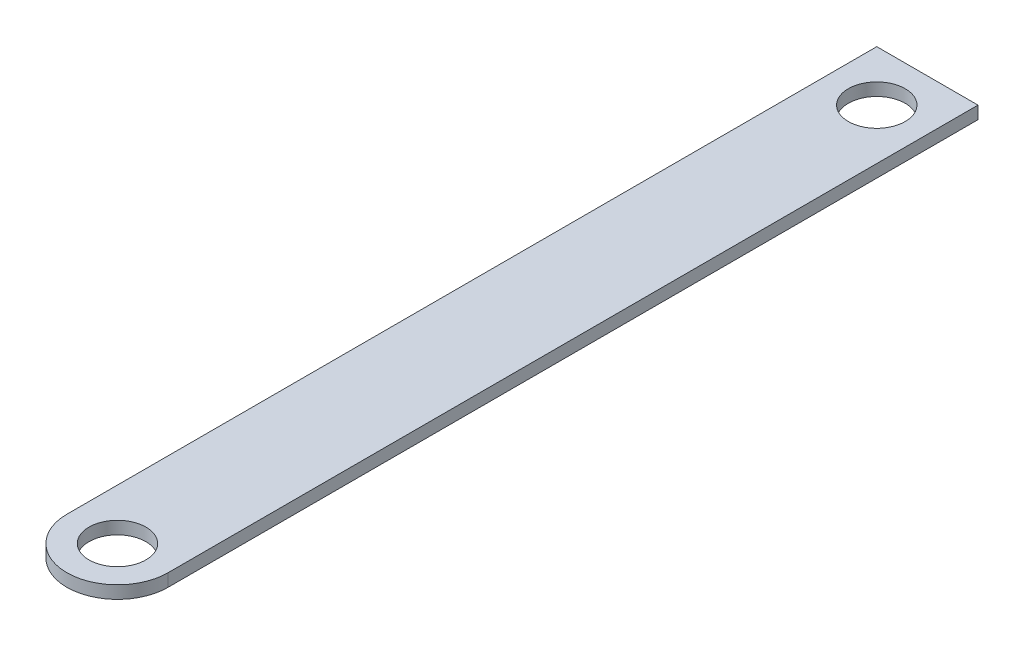
ISO-10303-21;
HEADER;
FILE_DESCRIPTION(('STEP AP214'),'2;1');
FILE_NAME('part.step','',(''),(''),'','','');
FILE_SCHEMA(('AUTOMOTIVE_DESIGN { 1 0 10303 214 1 1 1 1 }'));
ENDSEC;
DATA;
#1=APPLICATION_CONTEXT('core data for automotive mechanical design processes');
#2=APPLICATION_PROTOCOL_DEFINITION('international standard','automotive_design',2000,#1);
#3=PRODUCT_CONTEXT('',#1,'mechanical');
#4=PRODUCT('Part','Part','',(#3));
#5=PRODUCT_RELATED_PRODUCT_CATEGORY('part','',(#4));
#6=PRODUCT_DEFINITION_FORMATION('','',#4);
#7=PRODUCT_DEFINITION_CONTEXT('part definition',#1,'design');
#8=PRODUCT_DEFINITION('design','',#6,#7);
#9=PRODUCT_DEFINITION_SHAPE('','',#8);
#10=(LENGTH_UNIT() NAMED_UNIT(*) SI_UNIT(.MILLI.,.METRE.));
#11=(NAMED_UNIT(*) PLANE_ANGLE_UNIT() SI_UNIT($,.RADIAN.));
#12=(NAMED_UNIT(*) SI_UNIT($,.STERADIAN.) SOLID_ANGLE_UNIT());
#13=UNCERTAINTY_MEASURE_WITH_UNIT(LENGTH_MEASURE(1.E-05),#10,'distance_accuracy_value','');
#14=(GEOMETRIC_REPRESENTATION_CONTEXT(3) GLOBAL_UNCERTAINTY_ASSIGNED_CONTEXT((#13)) GLOBAL_UNIT_ASSIGNED_CONTEXT((#10,
#11,#12)) REPRESENTATION_CONTEXT('',''));
#15=CARTESIAN_POINT('',(0.,0.,0.));
#16=DIRECTION('',(0.,0.,1.));
#17=DIRECTION('',(1.,0.,0.));
#18=AXIS2_PLACEMENT_3D('',#15,#16,#17);
#19=CARTESIAN_POINT('',(25.4000000000001,6.35,-1.04083408558608E-13));
#20=DIRECTION('',(0.,1.,0.));
#21=DIRECTION('',(0.,0.,1.));
#22=AXIS2_PLACEMENT_3D('',#19,#20,#21);
#23=PLANE('',#22);
#24=CARTESIAN_POINT('',(25.4,6.35,0.));
#25=DIRECTION('',(0.,1.,0.));
#26=DIRECTION('',(0.,0.,1.));
#27=AXIS2_PLACEMENT_3D('',#24,#25,#26);
#28=CIRCLE('',#27,14.2748);
#29=CARTESIAN_POINT('',(25.4,6.35,14.2748));
#30=VERTEX_POINT('',#29);
#31=EDGE_CURVE('E99',#30,#30,#28,.T.);
#32=ORIENTED_EDGE('',*,*,#31,.F.);
#33=EDGE_LOOP('',(#32));
#34=FACE_BOUND('',#33,.T.);
#35=CARTESIAN_POINT('',(25.4000000000001,6.35,-1.04083408558608E-13));
#36=DIRECTION('',(0.,1.,0.));
#37=DIRECTION('',(0.,0.,1.));
#38=AXIS2_PLACEMENT_3D('',#35,#36,#37);
#39=CIRCLE('',#38,25.4000000000001);
#40=CARTESIAN_POINT('',(0.,6.35,0.));
#41=VERTEX_POINT('',#40);
#42=CARTESIAN_POINT('',(50.8,6.35,0.));
#43=VERTEX_POINT('',#42);
#44=EDGE_CURVE('E79',#41,#43,#39,.T.);
#45=ORIENTED_EDGE('',*,*,#44,.T.);
#46=DIRECTION('',(0.,0.,-1.));
#47=VECTOR('',#46,1.);
#48=CARTESIAN_POINT('',(50.8,6.35,0.));
#49=LINE('',#48,#47);
#50=CARTESIAN_POINT('',(50.8000000000001,6.35,-406.4));
#51=VERTEX_POINT('',#50);
#52=EDGE_CURVE('E82',#43,#51,#49,.T.);
#53=ORIENTED_EDGE('',*,*,#52,.T.);
#54=DIRECTION('',(-1.,0.,0.));
#55=VECTOR('',#54,1.);
#56=CARTESIAN_POINT('',(0.,6.35,-406.4));
#57=LINE('',#56,#55);
#58=CARTESIAN_POINT('',(0.,6.35,-406.4));
#59=VERTEX_POINT('',#58);
#60=EDGE_CURVE('E86',#51,#59,#57,.T.);
#61=ORIENTED_EDGE('',*,*,#60,.T.);
#62=DIRECTION('',(0.,0.,1.));
#63=VECTOR('',#62,1.);
#64=CARTESIAN_POINT('',(0.,6.35,0.));
#65=LINE('',#64,#63);
#66=EDGE_CURVE('E50',#59,#41,#65,.T.);
#67=ORIENTED_EDGE('',*,*,#66,.T.);
#68=EDGE_LOOP('',(#45,#53,#61,#67));
#69=FACE_BOUND('',#68,.T.);
#70=CARTESIAN_POINT('',(25.4000000000001,6.35,-381.));
#71=DIRECTION('',(0.,1.,0.));
#72=DIRECTION('',(0.,0.,1.));
#73=AXIS2_PLACEMENT_3D('',#70,#71,#72);
#74=CIRCLE('',#73,14.2748);
#75=CARTESIAN_POINT('',(25.4000000000001,6.35,-366.7252));
#76=VERTEX_POINT('',#75);
#77=EDGE_CURVE('E120',#76,#76,#74,.T.);
#78=ORIENTED_EDGE('',*,*,#77,.F.);
#79=EDGE_LOOP('',(#78));
#80=FACE_BOUND('',#79,.T.);
#81=ADVANCED_FACE('F33',(#34,#69,#80),#23,.T.);
#82=CARTESIAN_POINT('',(25.4000000000001,0.,-1.04083408558608E-13));
#83=DIRECTION('',(0.,1.,0.));
#84=DIRECTION('',(0.,0.,1.));
#85=AXIS2_PLACEMENT_3D('',#82,#83,#84);
#86=PLANE('',#85);
#87=CARTESIAN_POINT('',(25.4,0.,0.));
#88=DIRECTION('',(0.,1.,0.));
#89=DIRECTION('',(0.,0.,-1.));
#90=AXIS2_PLACEMENT_3D('',#87,#88,#89);
#91=CIRCLE('',#90,25.4);
#92=CARTESIAN_POINT('',(0.,0.,0.));
#93=VERTEX_POINT('',#92);
#94=CARTESIAN_POINT('',(50.8,0.,0.));
#95=VERTEX_POINT('',#94);
#96=EDGE_CURVE('E74',#93,#95,#91,.T.);
#97=ORIENTED_EDGE('',*,*,#96,.F.);
#98=DIRECTION('',(0.,0.,1.));
#99=VECTOR('',#98,1.);
#100=CARTESIAN_POINT('',(0.,0.,0.));
#101=LINE('',#100,#99);
#102=CARTESIAN_POINT('',(0.,0.,-406.4));
#103=VERTEX_POINT('',#102);
#104=EDGE_CURVE('E102',#103,#93,#101,.T.);
#105=ORIENTED_EDGE('',*,*,#104,.F.);
#106=DIRECTION('',(-1.,0.,0.));
#107=VECTOR('',#106,1.);
#108=CARTESIAN_POINT('',(0.,0.,-406.4));
#109=LINE('',#108,#107);
#110=CARTESIAN_POINT('',(50.8000000000001,0.,-406.4));
#111=VERTEX_POINT('',#110);
#112=EDGE_CURVE('E67',#111,#103,#109,.T.);
#113=ORIENTED_EDGE('',*,*,#112,.F.);
#114=DIRECTION('',(0.,0.,-1.));
#115=VECTOR('',#114,1.);
#116=CARTESIAN_POINT('',(50.8,0.,0.));
#117=LINE('',#116,#115);
#118=EDGE_CURVE('E90',#95,#111,#117,.T.);
#119=ORIENTED_EDGE('',*,*,#118,.F.);
#120=EDGE_LOOP('',(#97,#105,#113,#119));
#121=FACE_BOUND('',#120,.T.);
#122=CARTESIAN_POINT('',(25.4,0.,0.));
#123=DIRECTION('',(0.,1.,0.));
#124=DIRECTION('',(0.,0.,1.));
#125=AXIS2_PLACEMENT_3D('',#122,#123,#124);
#126=CIRCLE('',#125,14.2748);
#127=CARTESIAN_POINT('',(25.4,0.,14.2748));
#128=VERTEX_POINT('',#127);
#129=EDGE_CURVE('E115',#128,#128,#126,.T.);
#130=ORIENTED_EDGE('',*,*,#129,.T.);
#131=EDGE_LOOP('',(#130));
#132=FACE_BOUND('',#131,.T.);
#133=CARTESIAN_POINT('',(25.4000000000001,0.,-381.));
#134=DIRECTION('',(0.,1.,0.));
#135=DIRECTION('',(0.,0.,1.));
#136=AXIS2_PLACEMENT_3D('',#133,#134,#135);
#137=CIRCLE('',#136,14.2748);
#138=CARTESIAN_POINT('',(25.4000000000001,0.,-366.7252));
#139=VERTEX_POINT('',#138);
#140=EDGE_CURVE('E118',#139,#139,#137,.T.);
#141=ORIENTED_EDGE('',*,*,#140,.T.);
#142=EDGE_LOOP('',(#141));
#143=FACE_BOUND('',#142,.T.);
#144=ADVANCED_FACE('F108',(#121,#132,#143),#86,.F.);
#145=CARTESIAN_POINT('',(25.4,6.35,0.));
#146=DIRECTION('',(0.,-1.,0.));
#147=DIRECTION('',(0.,0.,-1.));
#148=AXIS2_PLACEMENT_3D('',#145,#146,#147);
#149=CYLINDRICAL_SURFACE('',#148,25.4);
#150=ORIENTED_EDGE('',*,*,#96,.T.);
#151=DIRECTION('',(0.,-1.,0.));
#152=VECTOR('',#151,1.);
#153=CARTESIAN_POINT('',(50.8,6.35,0.));
#154=LINE('',#153,#152);
#155=EDGE_CURVE('E11',#43,#95,#154,.T.);
#156=ORIENTED_EDGE('',*,*,#155,.F.);
#157=ORIENTED_EDGE('',*,*,#44,.F.);
#158=DIRECTION('',(0.,-1.,0.));
#159=VECTOR('',#158,1.);
#160=CARTESIAN_POINT('',(0.,6.35,0.));
#161=LINE('',#160,#159);
#162=EDGE_CURVE('E94',#41,#93,#161,.T.);
#163=ORIENTED_EDGE('',*,*,#162,.T.);
#164=EDGE_LOOP('',(#150,#156,#157,#163));
#165=FACE_BOUND('',#164,.T.);
#166=ADVANCED_FACE('F35',(#165),#149,.T.);
#167=CARTESIAN_POINT('',(50.8,6.35,0.));
#168=DIRECTION('',(-1.,0.,0.));
#169=DIRECTION('',(0.,0.,1.));
#170=AXIS2_PLACEMENT_3D('',#167,#168,#169);
#171=PLANE('',#170);
#172=ORIENTED_EDGE('',*,*,#118,.T.);
#173=DIRECTION('',(0.,-1.,0.));
#174=VECTOR('',#173,1.);
#175=CARTESIAN_POINT('',(50.8000000000001,6.35,-406.4));
#176=LINE('',#175,#174);
#177=EDGE_CURVE('E42',#51,#111,#176,.T.);
#178=ORIENTED_EDGE('',*,*,#177,.F.);
#179=ORIENTED_EDGE('',*,*,#52,.F.);
#180=ORIENTED_EDGE('',*,*,#155,.T.);
#181=EDGE_LOOP('',(#172,#178,#179,#180));
#182=FACE_BOUND('',#181,.T.);
#183=ADVANCED_FACE('F89',(#182),#171,.F.);
#184=CARTESIAN_POINT('',(0.,6.35,-406.4));
#185=DIRECTION('',(0.,0.,1.));
#186=DIRECTION('',(1.,0.,0.));
#187=AXIS2_PLACEMENT_3D('',#184,#185,#186);
#188=PLANE('',#187);
#189=ORIENTED_EDGE('',*,*,#112,.T.);
#190=DIRECTION('',(0.,-1.,0.));
#191=VECTOR('',#190,1.);
#192=CARTESIAN_POINT('',(0.,6.35,-406.4));
#193=LINE('',#192,#191);
#194=EDGE_CURVE('E91',#59,#103,#193,.T.);
#195=ORIENTED_EDGE('',*,*,#194,.F.);
#196=ORIENTED_EDGE('',*,*,#60,.F.);
#197=ORIENTED_EDGE('',*,*,#177,.T.);
#198=EDGE_LOOP('',(#189,#195,#196,#197));
#199=FACE_BOUND('',#198,.T.);
#200=ADVANCED_FACE('F92',(#199),#188,.F.);
#201=CARTESIAN_POINT('',(0.,6.35,0.));
#202=DIRECTION('',(1.,0.,0.));
#203=DIRECTION('',(0.,0.,-1.));
#204=AXIS2_PLACEMENT_3D('',#201,#202,#203);
#205=PLANE('',#204);
#206=ORIENTED_EDGE('',*,*,#104,.T.);
#207=ORIENTED_EDGE('',*,*,#162,.F.);
#208=ORIENTED_EDGE('',*,*,#66,.F.);
#209=ORIENTED_EDGE('',*,*,#194,.T.);
#210=EDGE_LOOP('',(#206,#207,#208,#209));
#211=FACE_BOUND('',#210,.T.);
#212=ADVANCED_FACE('F107',(#211),#205,.F.);
#213=CARTESIAN_POINT('',(25.4,6.35,0.));
#214=DIRECTION('',(0.,-1.,0.));
#215=DIRECTION('',(0.,0.,-1.));
#216=AXIS2_PLACEMENT_3D('',#213,#214,#215);
#217=CYLINDRICAL_SURFACE('',#216,14.2748);
#218=ORIENTED_EDGE('',*,*,#31,.T.);
#219=EDGE_LOOP('',(#218));
#220=FACE_BOUND('',#219,.T.);
#221=ORIENTED_EDGE('',*,*,#129,.F.);
#222=EDGE_LOOP('',(#221));
#223=FACE_BOUND('',#222,.T.);
#224=ADVANCED_FACE('F129',(#220,#223),#217,.F.);
#225=CARTESIAN_POINT('',(25.4000000000001,6.35,-381.));
#226=DIRECTION('',(0.,-1.,0.));
#227=DIRECTION('',(0.,0.,-1.));
#228=AXIS2_PLACEMENT_3D('',#225,#226,#227);
#229=CYLINDRICAL_SURFACE('',#228,14.2748);
#230=ORIENTED_EDGE('',*,*,#77,.T.);
#231=EDGE_LOOP('',(#230));
#232=FACE_BOUND('',#231,.T.);
#233=ORIENTED_EDGE('',*,*,#140,.F.);
#234=EDGE_LOOP('',(#233));
#235=FACE_BOUND('',#234,.T.);
#236=ADVANCED_FACE('F186',(#232,#235),#229,.F.);
#237=CLOSED_SHELL('',(#81,#144,#166,#183,#200,#212,#224,#236));
#238=MANIFOLD_SOLID_BREP('B2',#237);
#239=ADVANCED_BREP_SHAPE_REPRESENTATION('',(#18,#238),#14);
#240=SHAPE_DEFINITION_REPRESENTATION(#9,#239);
ENDSEC;
END-ISO-10303-21;
